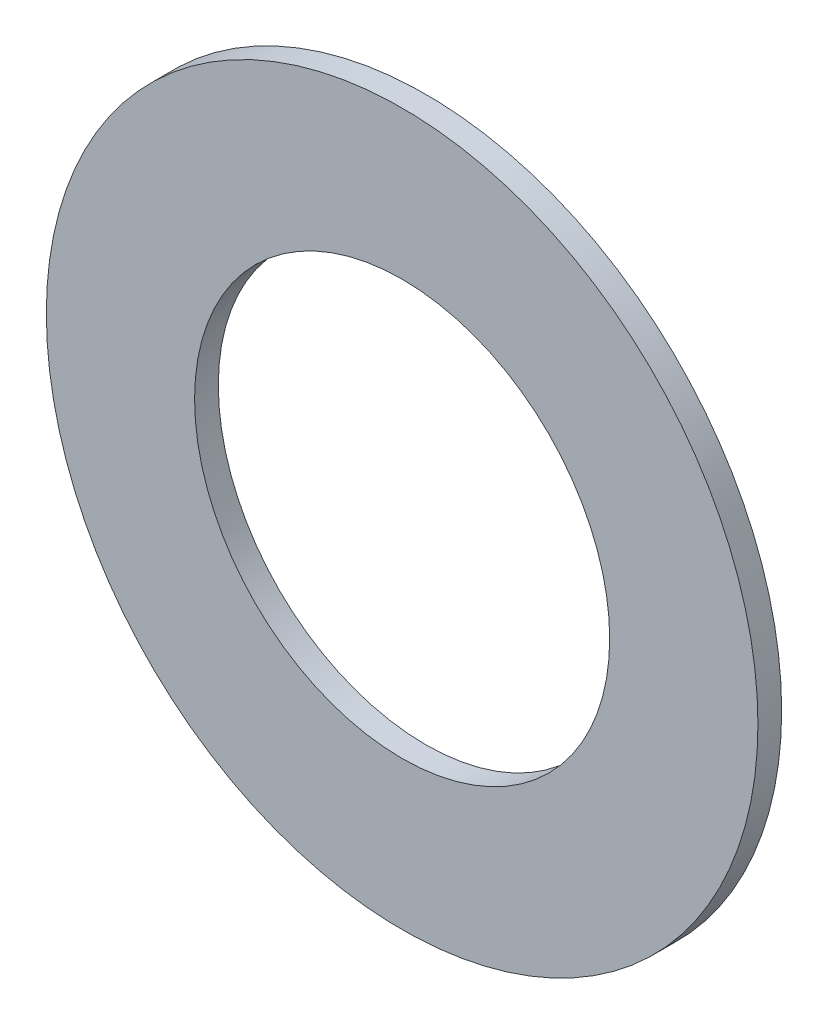
ISO-10303-21;
HEADER;
FILE_DESCRIPTION(('STEP AP214'),'2;1');
FILE_NAME('part.step','',(''),(''),'','','');
FILE_SCHEMA(('AUTOMOTIVE_DESIGN { 1 0 10303 214 1 1 1 1 }'));
ENDSEC;
DATA;
#1=APPLICATION_CONTEXT('core data for automotive mechanical design processes');
#2=APPLICATION_PROTOCOL_DEFINITION('international standard','automotive_design',2000,#1);
#3=PRODUCT_CONTEXT('',#1,'mechanical');
#4=PRODUCT('Part','Part','',(#3));
#5=PRODUCT_RELATED_PRODUCT_CATEGORY('part','',(#4));
#6=PRODUCT_DEFINITION_FORMATION('','',#4);
#7=PRODUCT_DEFINITION_CONTEXT('part definition',#1,'design');
#8=PRODUCT_DEFINITION('design','',#6,#7);
#9=PRODUCT_DEFINITION_SHAPE('','',#8);
#10=(LENGTH_UNIT() NAMED_UNIT(*) SI_UNIT(.MILLI.,.METRE.));
#11=(NAMED_UNIT(*) PLANE_ANGLE_UNIT() SI_UNIT($,.RADIAN.));
#12=(NAMED_UNIT(*) SI_UNIT($,.STERADIAN.) SOLID_ANGLE_UNIT());
#13=UNCERTAINTY_MEASURE_WITH_UNIT(LENGTH_MEASURE(1.E-05),#10,'distance_accuracy_value','');
#14=(GEOMETRIC_REPRESENTATION_CONTEXT(3) GLOBAL_UNCERTAINTY_ASSIGNED_CONTEXT((#13)) GLOBAL_UNIT_ASSIGNED_CONTEXT((#10,
#11,#12)) REPRESENTATION_CONTEXT('',''));
#15=CARTESIAN_POINT('',(0.,0.,0.));
#16=DIRECTION('',(0.,0.,1.));
#17=DIRECTION('',(1.,0.,0.));
#18=AXIS2_PLACEMENT_3D('',#15,#16,#17);
#19=CARTESIAN_POINT('',(0.,0.,1.));
#20=DIRECTION('',(0.,0.,1.));
#21=DIRECTION('',(1.,0.,0.));
#22=AXIS2_PLACEMENT_3D('',#19,#20,#21);
#23=PLANE('',#22);
#24=CARTESIAN_POINT('',(0.,0.,1.));
#25=DIRECTION('',(0.,0.,1.));
#26=DIRECTION('',(1.,0.,0.));
#27=AXIS2_PLACEMENT_3D('',#24,#25,#26);
#28=CIRCLE('',#27,15.);
#29=CARTESIAN_POINT('',(15.,0.,1.));
#30=VERTEX_POINT('',#29);
#31=EDGE_CURVE('E10',#30,#30,#28,.T.);
#32=ORIENTED_EDGE('',*,*,#31,.T.);
#33=EDGE_LOOP('',(#32));
#34=FACE_BOUND('',#33,.T.);
#35=CARTESIAN_POINT('',(0.,0.,1.));
#36=DIRECTION('',(0.,0.,1.));
#37=DIRECTION('',(1.,0.,0.));
#38=AXIS2_PLACEMENT_3D('',#35,#36,#37);
#39=CIRCLE('',#38,8.75);
#40=CARTESIAN_POINT('',(8.75,0.,1.));
#41=VERTEX_POINT('',#40);
#42=EDGE_CURVE('E52',#41,#41,#39,.T.);
#43=ORIENTED_EDGE('',*,*,#42,.F.);
#44=EDGE_LOOP('',(#43));
#45=FACE_BOUND('',#44,.T.);
#46=ADVANCED_FACE('F41',(#34,#45),#23,.T.);
#47=CARTESIAN_POINT('',(0.,0.,0.));
#48=DIRECTION('',(0.,0.,1.));
#49=DIRECTION('',(1.,0.,0.));
#50=AXIS2_PLACEMENT_3D('',#47,#48,#49);
#51=PLANE('',#50);
#52=CARTESIAN_POINT('',(0.,0.,0.));
#53=DIRECTION('',(0.,0.,1.));
#54=DIRECTION('',(1.,0.,0.));
#55=AXIS2_PLACEMENT_3D('',#52,#53,#54);
#56=CIRCLE('',#55,15.);
#57=CARTESIAN_POINT('',(15.,0.,0.));
#58=VERTEX_POINT('',#57);
#59=EDGE_CURVE('E45',#58,#58,#56,.T.);
#60=ORIENTED_EDGE('',*,*,#59,.F.);
#61=EDGE_LOOP('',(#60));
#62=FACE_BOUND('',#61,.T.);
#63=CARTESIAN_POINT('',(0.,0.,0.));
#64=DIRECTION('',(0.,0.,1.));
#65=DIRECTION('',(1.,0.,0.));
#66=AXIS2_PLACEMENT_3D('',#63,#64,#65);
#67=CIRCLE('',#66,8.75);
#68=CARTESIAN_POINT('',(8.75,0.,0.));
#69=VERTEX_POINT('',#68);
#70=EDGE_CURVE('E54',#69,#69,#67,.T.);
#71=ORIENTED_EDGE('',*,*,#70,.T.);
#72=EDGE_LOOP('',(#71));
#73=FACE_BOUND('',#72,.T.);
#74=ADVANCED_FACE('F64',(#62,#73),#51,.F.);
#75=CARTESIAN_POINT('',(0.,0.,1.));
#76=DIRECTION('',(0.,0.,-1.));
#77=DIRECTION('',(-1.,0.,0.));
#78=AXIS2_PLACEMENT_3D('',#75,#76,#77);
#79=CYLINDRICAL_SURFACE('',#78,15.);
#80=ORIENTED_EDGE('',*,*,#31,.F.);
#81=EDGE_LOOP('',(#80));
#82=FACE_BOUND('',#81,.T.);
#83=ORIENTED_EDGE('',*,*,#59,.T.);
#84=EDGE_LOOP('',(#83));
#85=FACE_BOUND('',#84,.T.);
#86=ADVANCED_FACE('F43',(#82,#85),#79,.T.);
#87=CARTESIAN_POINT('',(0.,0.,1.));
#88=DIRECTION('',(0.,0.,-1.));
#89=DIRECTION('',(-1.,0.,0.));
#90=AXIS2_PLACEMENT_3D('',#87,#88,#89);
#91=CYLINDRICAL_SURFACE('',#90,8.75);
#92=ORIENTED_EDGE('',*,*,#42,.T.);
#93=EDGE_LOOP('',(#92));
#94=FACE_BOUND('',#93,.T.);
#95=ORIENTED_EDGE('',*,*,#70,.F.);
#96=EDGE_LOOP('',(#95));
#97=FACE_BOUND('',#96,.T.);
#98=ADVANCED_FACE('F60',(#94,#97),#91,.F.);
#99=CLOSED_SHELL('',(#46,#74,#86,#98));
#100=MANIFOLD_SOLID_BREP('B2',#99);
#101=ADVANCED_BREP_SHAPE_REPRESENTATION('',(#18,#100),#14);
#102=SHAPE_DEFINITION_REPRESENTATION(#9,#101);
ENDSEC;
END-ISO-10303-21;
